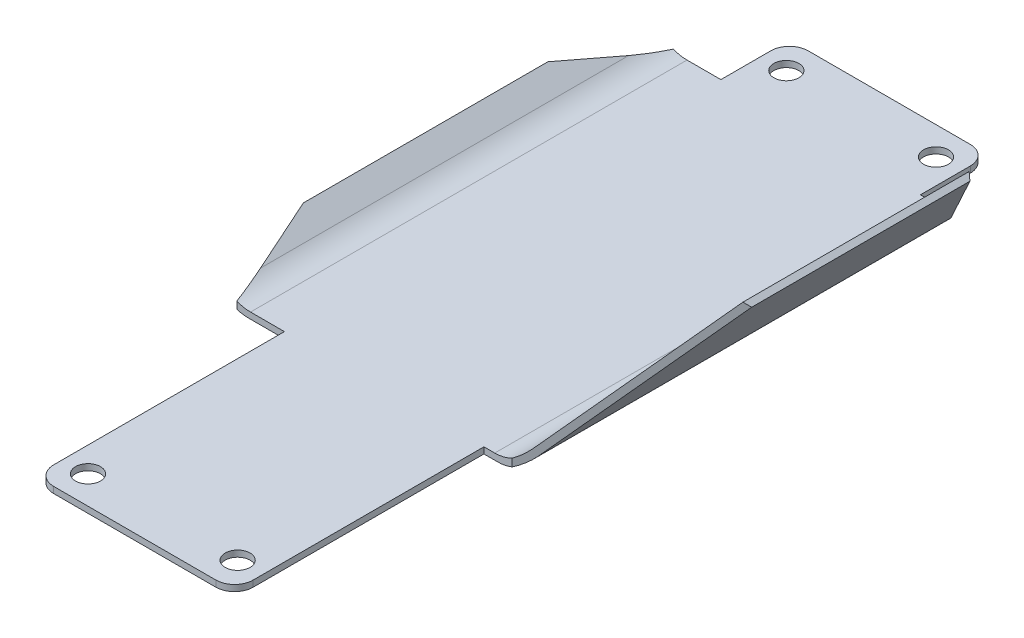
ISO-10303-21;
HEADER;
FILE_DESCRIPTION(('STEP AP214'),'2;1');
FILE_NAME('part.step','',(''),(''),'','','');
FILE_SCHEMA(('AUTOMOTIVE_DESIGN { 1 0 10303 214 1 1 1 1 }'));
ENDSEC;
DATA;
#1=APPLICATION_CONTEXT('core data for automotive mechanical design processes');
#2=APPLICATION_PROTOCOL_DEFINITION('international standard','automotive_design',2000,#1);
#3=PRODUCT_CONTEXT('',#1,'mechanical');
#4=PRODUCT('Part','Part','',(#3));
#5=PRODUCT_RELATED_PRODUCT_CATEGORY('part','',(#4));
#6=PRODUCT_DEFINITION_FORMATION('','',#4);
#7=PRODUCT_DEFINITION_CONTEXT('part definition',#1,'design');
#8=PRODUCT_DEFINITION('design','',#6,#7);
#9=PRODUCT_DEFINITION_SHAPE('','',#8);
#10=(LENGTH_UNIT() NAMED_UNIT(*) SI_UNIT(.MILLI.,.METRE.));
#11=(NAMED_UNIT(*) PLANE_ANGLE_UNIT() SI_UNIT($,.RADIAN.));
#12=(NAMED_UNIT(*) SI_UNIT($,.STERADIAN.) SOLID_ANGLE_UNIT());
#13=UNCERTAINTY_MEASURE_WITH_UNIT(LENGTH_MEASURE(1.E-05),#10,'distance_accuracy_value','');
#14=(GEOMETRIC_REPRESENTATION_CONTEXT(3) GLOBAL_UNCERTAINTY_ASSIGNED_CONTEXT((#13)) GLOBAL_UNIT_ASSIGNED_CONTEXT((#10,
#11,#12)) REPRESENTATION_CONTEXT('',''));
#15=CARTESIAN_POINT('',(0.,0.,0.));
#16=DIRECTION('',(0.,0.,1.));
#17=DIRECTION('',(1.,0.,0.));
#18=AXIS2_PLACEMENT_3D('',#15,#16,#17);
#19=CARTESIAN_POINT('',(-13.,0.,57.5));
#20=DIRECTION('',(0.,-1.,0.));
#21=DIRECTION('',(0.,0.,-1.));
#22=AXIS2_PLACEMENT_3D('',#19,#20,#21);
#23=PLANE('',#22);
#24=CARTESIAN_POINT('',(-12.,0.,-56.));
#25=DIRECTION('',(0.,1.,0.));
#26=DIRECTION('',(0.,0.,1.));
#27=AXIS2_PLACEMENT_3D('',#24,#25,#26);
#28=CIRCLE('',#27,2.);
#29=CARTESIAN_POINT('',(-12.,0.,-54.));
#30=VERTEX_POINT('',#29);
#31=EDGE_CURVE('E275',#30,#30,#28,.T.);
#32=ORIENTED_EDGE('',*,*,#31,.T.);
#33=EDGE_LOOP('',(#32));
#34=FACE_BOUND('',#33,.T.);
#35=CARTESIAN_POINT('',(12.,0.,-56.));
#36=DIRECTION('',(0.,1.,0.));
#37=DIRECTION('',(0.,0.,-1.));
#38=AXIS2_PLACEMENT_3D('',#35,#36,#37);
#39=CIRCLE('',#38,2.);
#40=CARTESIAN_POINT('',(12.,0.,-58.));
#41=VERTEX_POINT('',#40);
#42=EDGE_CURVE('E269',#41,#41,#39,.T.);
#43=ORIENTED_EDGE('',*,*,#42,.T.);
#44=EDGE_LOOP('',(#43));
#45=FACE_BOUND('',#44,.T.);
#46=CARTESIAN_POINT('',(-12.,0.,56.));
#47=DIRECTION('',(0.,1.,0.));
#48=DIRECTION('',(0.,0.,-1.));
#49=AXIS2_PLACEMENT_3D('',#46,#47,#48);
#50=CIRCLE('',#49,2.);
#51=CARTESIAN_POINT('',(-12.,0.,54.));
#52=VERTEX_POINT('',#51);
#53=EDGE_CURVE('E259',#52,#52,#50,.T.);
#54=ORIENTED_EDGE('',*,*,#53,.T.);
#55=EDGE_LOOP('',(#54));
#56=FACE_BOUND('',#55,.T.);
#57=CARTESIAN_POINT('',(12.,0.,56.));
#58=DIRECTION('',(0.,1.,0.));
#59=DIRECTION('',(0.,0.,1.));
#60=AXIS2_PLACEMENT_3D('',#57,#58,#59);
#61=CIRCLE('',#60,2.);
#62=CARTESIAN_POINT('',(12.,0.,58.));
#63=VERTEX_POINT('',#62);
#64=EDGE_CURVE('E263',#63,#63,#61,.T.);
#65=ORIENTED_EDGE('',*,*,#64,.T.);
#66=EDGE_LOOP('',(#65));
#67=FACE_BOUND('',#66,.T.);
#68=DIRECTION('',(1.,0.,0.));
#69=VECTOR('',#68,1.);
#70=CARTESIAN_POINT('',(-24.,0.,20.5));
#71=LINE('',#70,#69);
#72=CARTESIAN_POINT('',(-21.7996476918977,0.,20.5));
#73=VERTEX_POINT('',#72);
#74=CARTESIAN_POINT('',(-16.,0.,20.5));
#75=VERTEX_POINT('',#74);
#76=EDGE_CURVE('E435',#73,#75,#71,.T.);
#77=ORIENTED_EDGE('',*,*,#76,.F.);
#78=DIRECTION('',(0.,0.,1.));
#79=VECTOR('',#78,1.);
#80=CARTESIAN_POINT('',(-21.7996476918977,0.,57.5));
#81=LINE('',#80,#79);
#82=CARTESIAN_POINT('',(-21.7996476918977,0.,-49.5));
#83=VERTEX_POINT('',#82);
#84=EDGE_CURVE('E395',#73,#83,#81,.F.);
#85=ORIENTED_EDGE('',*,*,#84,.T.);
#86=DIRECTION('',(1.,0.,0.));
#87=VECTOR('',#86,1.);
#88=CARTESIAN_POINT('',(-24.,0.,-49.5));
#89=LINE('',#88,#87);
#90=CARTESIAN_POINT('',(-16.,0.,-49.5));
#91=VERTEX_POINT('',#90);
#92=EDGE_CURVE('E250',#83,#91,#89,.T.);
#93=ORIENTED_EDGE('',*,*,#92,.T.);
#94=DIRECTION('',(0.,0.,1.));
#95=VECTOR('',#94,1.);
#96=CARTESIAN_POINT('',(-16.,0.,57.5));
#97=LINE('',#96,#95);
#98=CARTESIAN_POINT('',(-16.,0.,-57.5));
#99=VERTEX_POINT('',#98);
#100=EDGE_CURVE('E288',#99,#91,#97,.T.);
#101=ORIENTED_EDGE('',*,*,#100,.F.);
#102=CARTESIAN_POINT('',(-13.,0.,-57.5));
#103=DIRECTION('',(0.,1.,0.));
#104=DIRECTION('',(0.,0.,-1.));
#105=AXIS2_PLACEMENT_3D('',#102,#103,#104);
#106=CIRCLE('',#105,3.);
#107=CARTESIAN_POINT('',(-13.,0.,-60.5));
#108=VERTEX_POINT('',#107);
#109=EDGE_CURVE('E320',#108,#99,#106,.T.);
#110=ORIENTED_EDGE('',*,*,#109,.F.);
#111=DIRECTION('',(-1.,0.,0.));
#112=VECTOR('',#111,1.);
#113=CARTESIAN_POINT('',(-13.,0.,-60.5));
#114=LINE('',#113,#112);
#115=CARTESIAN_POINT('',(13.,0.,-60.5));
#116=VERTEX_POINT('',#115);
#117=EDGE_CURVE('E318',#116,#108,#114,.T.);
#118=ORIENTED_EDGE('',*,*,#117,.F.);
#119=CARTESIAN_POINT('',(13.,0.,-57.5));
#120=DIRECTION('',(0.,1.,0.));
#121=DIRECTION('',(0.,0.,-1.));
#122=AXIS2_PLACEMENT_3D('',#119,#120,#121);
#123=CIRCLE('',#122,3.);
#124=CARTESIAN_POINT('',(16.,0.,-57.5));
#125=VERTEX_POINT('',#124);
#126=EDGE_CURVE('E316',#125,#116,#123,.T.);
#127=ORIENTED_EDGE('',*,*,#126,.F.);
#128=DIRECTION('',(0.,0.,-1.));
#129=VECTOR('',#128,1.);
#130=CARTESIAN_POINT('',(16.,0.,57.5));
#131=LINE('',#130,#129);
#132=CARTESIAN_POINT('',(16.,0.,-49.5));
#133=VERTEX_POINT('',#132);
#134=EDGE_CURVE('E313',#133,#125,#131,.T.);
#135=ORIENTED_EDGE('',*,*,#134,.F.);
#136=CARTESIAN_POINT('',(18.20215405107,0.,-49.5));
#137=VERTEX_POINT('',#136);
#138=EDGE_CURVE('E417',#133,#137,#89,.T.);
#139=ORIENTED_EDGE('',*,*,#138,.T.);
#140=DIRECTION('',(0.,0.,1.));
#141=VECTOR('',#140,1.);
#142=CARTESIAN_POINT('',(18.20215405107,0.,57.5));
#143=LINE('',#142,#141);
#144=CARTESIAN_POINT('',(18.20215405107,0.,20.5));
#145=VERTEX_POINT('',#144);
#146=EDGE_CURVE('E392',#137,#145,#143,.T.);
#147=ORIENTED_EDGE('',*,*,#146,.T.);
#148=CARTESIAN_POINT('',(16.,0.,20.5));
#149=VERTEX_POINT('',#148);
#150=EDGE_CURVE('E433',#149,#145,#71,.T.);
#151=ORIENTED_EDGE('',*,*,#150,.F.);
#152=CARTESIAN_POINT('',(16.,0.,57.5));
#153=VERTEX_POINT('',#152);
#154=EDGE_CURVE('E314',#153,#149,#131,.T.);
#155=ORIENTED_EDGE('',*,*,#154,.F.);
#156=CARTESIAN_POINT('',(13.,0.,57.5));
#157=DIRECTION('',(0.,1.,0.));
#158=DIRECTION('',(0.,0.,1.));
#159=AXIS2_PLACEMENT_3D('',#156,#157,#158);
#160=CIRCLE('',#159,3.);
#161=CARTESIAN_POINT('',(13.,0.,60.5));
#162=VERTEX_POINT('',#161);
#163=EDGE_CURVE('E311',#162,#153,#160,.T.);
#164=ORIENTED_EDGE('',*,*,#163,.F.);
#165=DIRECTION('',(1.,0.,0.));
#166=VECTOR('',#165,1.);
#167=CARTESIAN_POINT('',(-13.,0.,60.5));
#168=LINE('',#167,#166);
#169=CARTESIAN_POINT('',(-13.,0.,60.5));
#170=VERTEX_POINT('',#169);
#171=EDGE_CURVE('E309',#170,#162,#168,.T.);
#172=ORIENTED_EDGE('',*,*,#171,.F.);
#173=CARTESIAN_POINT('',(-13.,0.,57.5));
#174=DIRECTION('',(0.,1.,0.));
#175=DIRECTION('',(0.,0.,-1.));
#176=AXIS2_PLACEMENT_3D('',#173,#174,#175);
#177=CIRCLE('',#176,3.);
#178=CARTESIAN_POINT('',(-16.,0.,57.5));
#179=VERTEX_POINT('',#178);
#180=EDGE_CURVE('E281',#179,#170,#177,.T.);
#181=ORIENTED_EDGE('',*,*,#180,.F.);
#182=EDGE_CURVE('E322',#75,#179,#97,.T.);
#183=ORIENTED_EDGE('',*,*,#182,.F.);
#184=EDGE_LOOP('',(#77,#85,#93,#101,#110,#118,#127,#135,#139,#147,#151,#155,#164,#172,#181,#183));
#185=FACE_BOUND('',#184,.T.);
#186=ADVANCED_FACE('F33',(#34,#45,#56,#67,#185),#23,.T.);
#187=CARTESIAN_POINT('',(-24.,0.,-49.5));
#188=DIRECTION('',(-0.646504050809883,-0.762910553267165,0.));
#189=DIRECTION('',(0.762910553267165,-0.646504050809883,0.));
#190=AXIS2_PLACEMENT_3D('',#187,#188,#189);
#191=PLANE('',#190);
#192=DIRECTION('',(-0.284541894625022,0.24112589177381,0.927843852444735));
#193=VECTOR('',#192,1.);
#194=CARTESIAN_POINT('',(-23.6842882380084,-0.267539794988847,-49.3336530503948));
#195=LINE('',#194,#193);
#196=CARTESIAN_POINT('',(-25.678671996757,1.42253668039701,-42.8302989049211));
#197=VERTEX_POINT('',#196);
#198=CARTESIAN_POINT('',(-29.,4.23708944673283,-32.));
#199=VERTEX_POINT('',#198);
#200=EDGE_CURVE('E449',#197,#199,#195,.T.);
#201=ORIENTED_EDGE('',*,*,#200,.F.);
#202=DIRECTION('',(0.,0.,1.));
#203=VECTOR('',#202,1.);
#204=CARTESIAN_POINT('',(-25.678671996757,1.42253668039701,-49.5));
#205=LINE('',#204,#203);
#206=CARTESIAN_POINT('',(-25.678671996757,1.42253668039701,13.8302989049211));
#207=VERTEX_POINT('',#206);
#208=EDGE_CURVE('E385',#197,#207,#205,.T.);
#209=ORIENTED_EDGE('',*,*,#208,.T.);
#210=DIRECTION('',(-0.284541894625022,0.24112589177381,-0.927843852444735));
#211=VECTOR('',#210,1.);
#212=CARTESIAN_POINT('',(-42.1650195763647,15.393362549342,-39.9289419659694));
#213=LINE('',#212,#211);
#214=CARTESIAN_POINT('',(-29.,4.23708944673283,3.));
#215=VERTEX_POINT('',#214);
#216=EDGE_CURVE('E452',#207,#215,#213,.T.);
#217=ORIENTED_EDGE('',*,*,#216,.T.);
#218=DIRECTION('',(0.,0.,1.));
#219=VECTOR('',#218,1.);
#220=CARTESIAN_POINT('',(-29.,4.23708944673283,-49.5));
#221=LINE('',#220,#219);
#222=EDGE_CURVE('E248',#199,#215,#221,.T.);
#223=ORIENTED_EDGE('',*,*,#222,.F.);
#224=EDGE_LOOP('',(#201,#209,#217,#223));
#225=FACE_BOUND('',#224,.T.);
#226=ADVANCED_FACE('F448',(#225),#191,.T.);
#227=CARTESIAN_POINT('',(-28.3534959491901,5.,-49.5));
#228=DIRECTION('',(-0.762910553267166,0.646504050809882,0.));
#229=DIRECTION('',(-0.646504050809882,-0.762910553267166,0.));
#230=AXIS2_PLACEMENT_3D('',#227,#228,#229);
#231=PLANE('',#230);
#232=ORIENTED_EDGE('',*,*,#222,.T.);
#233=DIRECTION('',(0.277077755474065,0.32696708313264,0.903504534559283));
#234=VECTOR('',#233,1.);
#235=CARTESIAN_POINT('',(-42.0241533690322,-11.1321322003049,-39.4696006634774));
#236=LINE('',#235,#234);
#237=CARTESIAN_POINT('',(-28.3534959491901,5.,5.10814231737321));
#238=VERTEX_POINT('',#237);
#239=EDGE_CURVE('E444',#215,#238,#236,.T.);
#240=ORIENTED_EDGE('',*,*,#239,.T.);
#241=DIRECTION('',(0.,0.,1.));
#242=VECTOR('',#241,1.);
#243=CARTESIAN_POINT('',(-28.3534959491901,5.,-49.5));
#244=LINE('',#243,#242);
#245=CARTESIAN_POINT('',(-28.3534959491901,5.,-34.1081423173732));
#246=VERTEX_POINT('',#245);
#247=EDGE_CURVE('E244',#246,#238,#244,.T.);
#248=ORIENTED_EDGE('',*,*,#247,.F.);
#249=DIRECTION('',(0.277077755474065,0.32696708313264,-0.903504534559283));
#250=VECTOR('',#249,1.);
#251=CARTESIAN_POINT('',(-24.5002827742894,9.54700475803252,-46.6728304143657));
#252=LINE('',#251,#250);
#253=EDGE_CURVE('E445',#199,#246,#252,.T.);
#254=ORIENTED_EDGE('',*,*,#253,.F.);
#255=EDGE_LOOP('',(#232,#240,#248,#254));
#256=FACE_BOUND('',#255,.T.);
#257=ADVANCED_FACE('F441',(#256),#231,.T.);
#258=CARTESIAN_POINT('',(-23.6332746153163,1.,-49.5));
#259=DIRECTION('',(0.646504050809883,0.762910553267165,0.));
#260=DIRECTION('',(-0.762910553267165,0.646504050809883,0.));
#261=AXIS2_PLACEMENT_3D('',#258,#259,#260);
#262=PLANE('',#261);
#263=DIRECTION('',(0.284541894625022,-0.241125891773809,0.927843852444735));
#264=VECTOR('',#263,1.);
#265=CARTESIAN_POINT('',(-42.1140059536726,16.6609023443309,-39.7625950163642));
#266=LINE('',#265,#264);
#267=CARTESIAN_POINT('',(-25.3119466120733,2.42253668039701,15.0261294667532));
#268=VERTEX_POINT('',#267);
#269=EDGE_CURVE('E456',#238,#268,#266,.T.);
#270=ORIENTED_EDGE('',*,*,#269,.T.);
#271=DIRECTION('',(0.,0.,1.));
#272=VECTOR('',#271,1.);
#273=CARTESIAN_POINT('',(-25.3119466120733,2.42253668039701,-49.5));
#274=LINE('',#273,#272);
#275=CARTESIAN_POINT('',(-25.3119466120733,2.42253668039701,-44.0261294667532));
#276=VERTEX_POINT('',#275);
#277=EDGE_CURVE('E363',#268,#276,#274,.F.);
#278=ORIENTED_EDGE('',*,*,#277,.T.);
#279=DIRECTION('',(0.284541894625022,-0.241125891773809,-0.927843852444735));
#280=VECTOR('',#279,1.);
#281=CARTESIAN_POINT('',(-23.6332746153163,0.999999999999997,-49.5));
#282=LINE('',#281,#280);
#283=EDGE_CURVE('E462',#246,#276,#282,.T.);
#284=ORIENTED_EDGE('',*,*,#283,.F.);
#285=ORIENTED_EDGE('',*,*,#247,.T.);
#286=EDGE_LOOP('',(#270,#278,#284,#285));
#287=FACE_BOUND('',#286,.T.);
#288=ADVANCED_FACE('F722',(#287),#262,.T.);
#289=CARTESIAN_POINT('',(0.,0.,20.5));
#290=DIRECTION('',(0.,0.,-1.));
#291=DIRECTION('',(-1.,0.,0.));
#292=AXIS2_PLACEMENT_3D('',#289,#290,#291);
#293=PLANE('',#292);
#294=DIRECTION('',(0.,1.,0.));
#295=VECTOR('',#294,1.);
#296=CARTESIAN_POINT('',(-23.6332746153163,0.,20.5));
#297=LINE('',#296,#295);
#298=CARTESIAN_POINT('',(-23.6332746153163,0.287048721920121,20.5));
#299=VERTEX_POINT('',#298);
#300=CARTESIAN_POINT('',(-23.6332746153163,1.41802456828867,20.5));
#301=VERTEX_POINT('',#300);
#302=EDGE_CURVE('E356',#299,#301,#297,.T.);
#303=ORIENTED_EDGE('',*,*,#302,.F.);
#304=CARTESIAN_POINT('',(-21.7996476918977,6.,20.5));
#305=DIRECTION('',(0.,0.,-1.));
#306=DIRECTION('',(-1.,0.,0.));
#307=AXIS2_PLACEMENT_3D('',#304,#305,#306);
#308=CIRCLE('',#307,6.);
#309=EDGE_CURVE('E390',#299,#73,#308,.F.);
#310=ORIENTED_EDGE('',*,*,#309,.T.);
#311=ORIENTED_EDGE('',*,*,#76,.T.);
#312=DIRECTION('',(0.,1.,0.));
#313=VECTOR('',#312,1.);
#314=CARTESIAN_POINT('',(-16.,1.,20.5));
#315=LINE('',#314,#313);
#316=CARTESIAN_POINT('',(-16.,1.,20.5));
#317=VERTEX_POINT('',#316);
#318=EDGE_CURVE('E348',#75,#317,#315,.T.);
#319=ORIENTED_EDGE('',*,*,#318,.T.);
#320=DIRECTION('',(-1.,0.,0.));
#321=VECTOR('',#320,1.);
#322=CARTESIAN_POINT('',(-23.6332746153163,1.,20.5));
#323=LINE('',#322,#321);
#324=CARTESIAN_POINT('',(-21.432922307214,1.,20.5));
#325=VERTEX_POINT('',#324);
#326=EDGE_CURVE('E434',#317,#325,#323,.T.);
#327=ORIENTED_EDGE('',*,*,#326,.T.);
#328=CARTESIAN_POINT('',(-21.432922307214,7.,20.5));
#329=DIRECTION('',(0.,0.,-1.));
#330=DIRECTION('',(-1.,0.,0.));
#331=AXIS2_PLACEMENT_3D('',#328,#329,#330);
#332=CIRCLE('',#331,6.);
#333=EDGE_CURVE('E366',#325,#301,#332,.T.);
#334=ORIENTED_EDGE('',*,*,#333,.T.);
#335=EDGE_LOOP('',(#303,#310,#311,#319,#327,#334));
#336=FACE_BOUND('',#335,.T.);
#337=ADVANCED_FACE('F511',(#336),#293,.F.);
#338=CARTESIAN_POINT('',(0.,0.,-49.5));
#339=DIRECTION('',(0.,0.,-1.));
#340=DIRECTION('',(-1.,0.,0.));
#341=AXIS2_PLACEMENT_3D('',#338,#339,#340);
#342=PLANE('',#341);
#343=DIRECTION('',(0.,-1.,0.));
#344=VECTOR('',#343,1.);
#345=CARTESIAN_POINT('',(20.533692341845,70.,-49.5));
#346=LINE('',#345,#344);
#347=CARTESIAN_POINT('',(20.533692341845,1.69226432025328,-49.5));
#348=VERTEX_POINT('',#347);
#349=CARTESIAN_POINT('',(20.533692341845,0.471534643443086,-49.5));
#350=VERTEX_POINT('',#349);
#351=EDGE_CURVE('E418',#348,#350,#346,.T.);
#352=ORIENTED_EDGE('',*,*,#351,.T.);
#353=CARTESIAN_POINT('',(18.20215405107,6.,-49.5));
#354=DIRECTION('',(0.,0.,-1.));
#355=DIRECTION('',(-1.,0.,0.));
#356=AXIS2_PLACEMENT_3D('',#353,#354,#355);
#357=CIRCLE('',#356,6.);
#358=EDGE_CURVE('E11',#350,#137,#357,.T.);
#359=ORIENTED_EDGE('',*,*,#358,.T.);
#360=ORIENTED_EDGE('',*,*,#138,.F.);
#361=DIRECTION('',(0.,-1.,0.));
#362=VECTOR('',#361,1.);
#363=CARTESIAN_POINT('',(16.,1.,-49.5));
#364=LINE('',#363,#362);
#365=CARTESIAN_POINT('',(16.,1.,-49.5));
#366=VERTEX_POINT('',#365);
#367=EDGE_CURVE('E257',#366,#133,#364,.T.);
#368=ORIENTED_EDGE('',*,*,#367,.F.);
#369=DIRECTION('',(-1.,0.,0.));
#370=VECTOR('',#369,1.);
#371=CARTESIAN_POINT('',(-23.6332746153163,1.,-49.5));
#372=LINE('',#371,#370);
#373=CARTESIAN_POINT('',(17.735846392915,1.,-49.5));
#374=VERTEX_POINT('',#373);
#375=EDGE_CURVE('E425',#374,#366,#372,.T.);
#376=ORIENTED_EDGE('',*,*,#375,.F.);
#377=CARTESIAN_POINT('',(17.735846392915,7.,-49.5));
#378=DIRECTION('',(0.,0.,-1.));
#379=DIRECTION('',(-1.,0.,0.));
#380=AXIS2_PLACEMENT_3D('',#377,#378,#379);
#381=CIRCLE('',#380,6.);
#382=EDGE_CURVE('E380',#374,#348,#381,.F.);
#383=ORIENTED_EDGE('',*,*,#382,.T.);
#384=EDGE_LOOP('',(#352,#359,#360,#368,#376,#383));
#385=FACE_BOUND('',#384,.T.);
#386=ADVANCED_FACE('F415',(#385),#342,.T.);
#387=CARTESIAN_POINT('',(21.,0.,-49.5));
#388=DIRECTION('',(0.76604444311898,-0.642787609686537,0.));
#389=DIRECTION('',(0.642787609686537,0.76604444311898,0.));
#390=AXIS2_PLACEMENT_3D('',#387,#388,#389);
#391=PLANE('',#390);
#392=DIRECTION('',(0.566040115034933,0.674580340645325,-0.473856467916264));
#393=VECTOR('',#392,1.);
#394=CARTESIAN_POINT('',(39.6708191733897,22.2510158265642,4.47948999444729));
#395=LINE('',#394,#393);
#396=CARTESIAN_POINT('',(22.7984207097839,2.14327434188078,18.6040987083485));
#397=VERTEX_POINT('',#396);
#398=CARTESIAN_POINT('',(41.4381279332186,24.3572123903135,3.));
#399=VERTEX_POINT('',#398);
#400=EDGE_CURVE('E223',#397,#399,#395,.T.);
#401=ORIENTED_EDGE('',*,*,#400,.F.);
#402=DIRECTION('',(0.,0.,1.));
#403=VECTOR('',#402,1.);
#404=CARTESIAN_POINT('',(22.7984207097839,2.14327434188078,-49.5));
#405=LINE('',#404,#403);
#406=CARTESIAN_POINT('',(22.7984207097839,2.14327434188078,-47.6040987083485));
#407=VERTEX_POINT('',#406);
#408=EDGE_CURVE('E55',#397,#407,#405,.F.);
#409=ORIENTED_EDGE('',*,*,#408,.T.);
#410=DIRECTION('',(0.566040115034933,0.674580340645325,0.473856467916264));
#411=VECTOR('',#410,1.);
#412=CARTESIAN_POINT('',(20.8952953007339,-0.124782201511901,-49.1972866474727));
#413=LINE('',#412,#411);
#414=CARTESIAN_POINT('',(41.4381279332186,24.3572123903135,-32.));
#415=VERTEX_POINT('',#414);
#416=EDGE_CURVE('E465',#407,#415,#413,.T.);
#417=ORIENTED_EDGE('',*,*,#416,.T.);
#418=DIRECTION('',(0.,0.,1.));
#419=VECTOR('',#418,1.);
#420=CARTESIAN_POINT('',(41.4381279332186,24.3572123903135,-49.5));
#421=LINE('',#420,#419);
#422=EDGE_CURVE('E245',#415,#399,#421,.T.);
#423=ORIENTED_EDGE('',*,*,#422,.T.);
#424=EDGE_LOOP('',(#401,#409,#417,#423));
#425=FACE_BOUND('',#424,.T.);
#426=ADVANCED_FACE('F407',(#425),#391,.T.);
#427=CARTESIAN_POINT('',(20.533692341845,1.,-49.5));
#428=DIRECTION('',(-0.76604444311898,0.642787609686537,0.));
#429=DIRECTION('',(-0.642787609686537,-0.76604444311898,0.));
#430=AXIS2_PLACEMENT_3D('',#427,#428,#429);
#431=PLANE('',#430);
#432=DIRECTION('',(-0.566040115034933,-0.674580340645325,-0.473856467916264));
#433=VECTOR('',#432,1.);
#434=CARTESIAN_POINT('',(20.533692341845,1.,-49.5));
#435=LINE('',#434,#433);
#436=CARTESIAN_POINT('',(40.6720834900996,25.,-32.641288672731));
#437=VERTEX_POINT('',#436);
#438=CARTESIAN_POINT('',(22.3321130516289,3.14327434188078,-47.9944648572954));
#439=VERTEX_POINT('',#438);
#440=EDGE_CURVE('E408',#437,#439,#435,.T.);
#441=ORIENTED_EDGE('',*,*,#440,.T.);
#442=DIRECTION('',(0.,0.,1.));
#443=VECTOR('',#442,1.);
#444=CARTESIAN_POINT('',(22.3321130516289,3.14327434188078,-49.5));
#445=LINE('',#444,#443);
#446=CARTESIAN_POINT('',(22.3321130516289,3.14327434188078,18.9944648572954));
#447=VERTEX_POINT('',#446);
#448=EDGE_CURVE('E238',#439,#447,#445,.T.);
#449=ORIENTED_EDGE('',*,*,#448,.T.);
#450=DIRECTION('',(-0.566040115034933,-0.674580340645325,0.473856467916264));
#451=VECTOR('',#450,1.);
#452=CARTESIAN_POINT('',(39.3092162145008,23.3757980280761,4.78220334697457));
#453=LINE('',#452,#451);
#454=CARTESIAN_POINT('',(40.6720834900996,25.,3.64128867273096));
#455=VERTEX_POINT('',#454);
#456=EDGE_CURVE('E222',#455,#447,#453,.T.);
#457=ORIENTED_EDGE('',*,*,#456,.F.);
#458=DIRECTION('',(0.,0.,1.));
#459=VECTOR('',#458,1.);
#460=CARTESIAN_POINT('',(40.6720834900996,25.,-49.5));
#461=LINE('',#460,#459);
#462=EDGE_CURVE('E236',#437,#455,#461,.T.);
#463=ORIENTED_EDGE('',*,*,#462,.F.);
#464=EDGE_LOOP('',(#441,#449,#457,#463));
#465=FACE_BOUND('',#464,.T.);
#466=ADVANCED_FACE('F235',(#465),#431,.T.);
#467=CARTESIAN_POINT('',(40.6720834900996,25.,-49.5));
#468=DIRECTION('',(0.642787609686539,0.766044443118978,0.));
#469=DIRECTION('',(-0.766044443118978,0.642787609686539,0.));
#470=AXIS2_PLACEMENT_3D('',#467,#468,#469);
#471=PLANE('',#470);
#472=ORIENTED_EDGE('',*,*,#422,.F.);
#473=DIRECTION('',(-0.644839763946836,0.541084808096234,-0.539823035151753));
#474=VECTOR('',#473,1.);
#475=CARTESIAN_POINT('',(34.8035768909236,29.92426172293,-37.5540673524844));
#476=LINE('',#475,#474);
#477=EDGE_CURVE('E228',#415,#437,#476,.T.);
#478=ORIENTED_EDGE('',*,*,#477,.T.);
#479=ORIENTED_EDGE('',*,*,#462,.T.);
#480=DIRECTION('',(-0.644839763946836,0.541084808096234,0.539823035151753));
#481=VECTOR('',#480,1.);
#482=CARTESIAN_POINT('',(59.1705319901461,9.47795868625909,-11.8445562971472));
#483=LINE('',#482,#481);
#484=EDGE_CURVE('E217',#399,#455,#483,.T.);
#485=ORIENTED_EDGE('',*,*,#484,.F.);
#486=EDGE_LOOP('',(#472,#478,#479,#485));
#487=FACE_BOUND('',#486,.T.);
#488=ADVANCED_FACE('F242',(#487),#471,.T.);
#489=CARTESIAN_POINT('',(16.,1.,57.5));
#490=DIRECTION('',(-1.,0.,0.));
#491=DIRECTION('',(0.,0.,1.));
#492=AXIS2_PLACEMENT_3D('',#489,#490,#491);
#493=PLANE('',#492);
#494=DIRECTION('',(0.,-1.,0.));
#495=VECTOR('',#494,1.);
#496=CARTESIAN_POINT('',(16.,1.,20.5));
#497=LINE('',#496,#495);
#498=CARTESIAN_POINT('',(16.,1.,20.5));
#499=VERTEX_POINT('',#498);
#500=EDGE_CURVE('E254',#499,#149,#497,.T.);
#501=ORIENTED_EDGE('',*,*,#500,.F.);
#502=DIRECTION('',(0.,0.,-1.));
#503=VECTOR('',#502,1.);
#504=CARTESIAN_POINT('',(16.,1.,57.5));
#505=LINE('',#504,#503);
#506=CARTESIAN_POINT('',(16.,1.,57.5));
#507=VERTEX_POINT('',#506);
#508=EDGE_CURVE('E293',#507,#499,#505,.T.);
#509=ORIENTED_EDGE('',*,*,#508,.F.);
#510=DIRECTION('',(0.,-1.,0.));
#511=VECTOR('',#510,1.);
#512=CARTESIAN_POINT('',(16.,1.,57.5));
#513=LINE('',#512,#511);
#514=EDGE_CURVE('E339',#507,#153,#513,.T.);
#515=ORIENTED_EDGE('',*,*,#514,.T.);
#516=ORIENTED_EDGE('',*,*,#154,.T.);
#517=EDGE_LOOP('',(#501,#509,#515,#516));
#518=FACE_BOUND('',#517,.T.);
#519=ADVANCED_FACE('F488',(#518),#493,.F.);
#520=CARTESIAN_POINT('',(-16.,1.,57.5));
#521=DIRECTION('',(1.,0.,0.));
#522=DIRECTION('',(0.,0.,-1.));
#523=AXIS2_PLACEMENT_3D('',#520,#521,#522);
#524=PLANE('',#523);
#525=ORIENTED_EDGE('',*,*,#318,.F.);
#526=ORIENTED_EDGE('',*,*,#182,.T.);
#527=DIRECTION('',(0.,-1.,0.));
#528=VECTOR('',#527,1.);
#529=CARTESIAN_POINT('',(-16.,1.,57.5));
#530=LINE('',#529,#528);
#531=CARTESIAN_POINT('',(-16.,1.,57.5));
#532=VERTEX_POINT('',#531);
#533=EDGE_CURVE('E306',#532,#179,#530,.T.);
#534=ORIENTED_EDGE('',*,*,#533,.F.);
#535=DIRECTION('',(0.,0.,1.));
#536=VECTOR('',#535,1.);
#537=CARTESIAN_POINT('',(-16.,1.,57.5));
#538=LINE('',#537,#536);
#539=EDGE_CURVE('E302',#317,#532,#538,.T.);
#540=ORIENTED_EDGE('',*,*,#539,.F.);
#541=EDGE_LOOP('',(#525,#526,#534,#540));
#542=FACE_BOUND('',#541,.T.);
#543=ADVANCED_FACE('F506',(#542),#524,.F.);
#544=CARTESIAN_POINT('',(-13.,1.,57.5));
#545=DIRECTION('',(0.,-1.,0.));
#546=DIRECTION('',(0.,0.,-1.));
#547=AXIS2_PLACEMENT_3D('',#544,#545,#546);
#548=PLANE('',#547);
#549=CARTESIAN_POINT('',(-16.,1.,-49.5));
#550=VERTEX_POINT('',#549);
#551=CARTESIAN_POINT('',(-21.432922307214,1.,-49.5));
#552=VERTEX_POINT('',#551);
#553=EDGE_CURVE('E427',#550,#552,#372,.T.);
#554=ORIENTED_EDGE('',*,*,#553,.T.);
#555=DIRECTION('',(0.,0.,1.));
#556=VECTOR('',#555,1.);
#557=CARTESIAN_POINT('',(-21.432922307214,1.,57.5));
#558=LINE('',#557,#556);
#559=EDGE_CURVE('E360',#552,#325,#558,.T.);
#560=ORIENTED_EDGE('',*,*,#559,.T.);
#561=ORIENTED_EDGE('',*,*,#326,.F.);
#562=ORIENTED_EDGE('',*,*,#539,.T.);
#563=CARTESIAN_POINT('',(-13.,1.,57.5));
#564=DIRECTION('',(0.,1.,0.));
#565=DIRECTION('',(0.,0.,-1.));
#566=AXIS2_PLACEMENT_3D('',#563,#564,#565);
#567=CIRCLE('',#566,3.);
#568=CARTESIAN_POINT('',(-13.,1.,60.5));
#569=VERTEX_POINT('',#568);
#570=EDGE_CURVE('E284',#532,#569,#567,.T.);
#571=ORIENTED_EDGE('',*,*,#570,.T.);
#572=DIRECTION('',(1.,0.,0.));
#573=VECTOR('',#572,1.);
#574=CARTESIAN_POINT('',(-13.,1.,60.5));
#575=LINE('',#574,#573);
#576=CARTESIAN_POINT('',(13.,1.,60.5));
#577=VERTEX_POINT('',#576);
#578=EDGE_CURVE('E287',#569,#577,#575,.T.);
#579=ORIENTED_EDGE('',*,*,#578,.T.);
#580=CARTESIAN_POINT('',(13.,1.,57.5));
#581=DIRECTION('',(0.,1.,0.));
#582=DIRECTION('',(0.,0.,1.));
#583=AXIS2_PLACEMENT_3D('',#580,#581,#582);
#584=CIRCLE('',#583,3.);
#585=EDGE_CURVE('E290',#577,#507,#584,.T.);
#586=ORIENTED_EDGE('',*,*,#585,.T.);
#587=ORIENTED_EDGE('',*,*,#508,.T.);
#588=CARTESIAN_POINT('',(17.735846392915,1.,20.5));
#589=VERTEX_POINT('',#588);
#590=EDGE_CURVE('E431',#589,#499,#323,.T.);
#591=ORIENTED_EDGE('',*,*,#590,.F.);
#592=DIRECTION('',(0.,0.,1.));
#593=VECTOR('',#592,1.);
#594=CARTESIAN_POINT('',(17.735846392915,1.,57.5));
#595=LINE('',#594,#593);
#596=EDGE_CURVE('E358',#589,#374,#595,.F.);
#597=ORIENTED_EDGE('',*,*,#596,.T.);
#598=ORIENTED_EDGE('',*,*,#375,.T.);
#599=CARTESIAN_POINT('',(16.,1.,-57.5));
#600=VERTEX_POINT('',#599);
#601=EDGE_CURVE('E292',#366,#600,#505,.T.);
#602=ORIENTED_EDGE('',*,*,#601,.T.);
#603=CARTESIAN_POINT('',(13.,1.,-57.5));
#604=DIRECTION('',(0.,1.,0.));
#605=DIRECTION('',(0.,0.,-1.));
#606=AXIS2_PLACEMENT_3D('',#603,#604,#605);
#607=CIRCLE('',#606,3.);
#608=CARTESIAN_POINT('',(13.,1.,-60.5));
#609=VERTEX_POINT('',#608);
#610=EDGE_CURVE('E296',#600,#609,#607,.T.);
#611=ORIENTED_EDGE('',*,*,#610,.T.);
#612=DIRECTION('',(-1.,0.,0.));
#613=VECTOR('',#612,1.);
#614=CARTESIAN_POINT('',(-13.,1.,-60.5));
#615=LINE('',#614,#613);
#616=CARTESIAN_POINT('',(-13.,1.,-60.5));
#617=VERTEX_POINT('',#616);
#618=EDGE_CURVE('E298',#609,#617,#615,.T.);
#619=ORIENTED_EDGE('',*,*,#618,.T.);
#620=CARTESIAN_POINT('',(-13.,1.,-57.5));
#621=DIRECTION('',(0.,1.,0.));
#622=DIRECTION('',(0.,0.,-1.));
#623=AXIS2_PLACEMENT_3D('',#620,#621,#622);
#624=CIRCLE('',#623,3.);
#625=CARTESIAN_POINT('',(-16.,1.,-57.5));
#626=VERTEX_POINT('',#625);
#627=EDGE_CURVE('E300',#617,#626,#624,.T.);
#628=ORIENTED_EDGE('',*,*,#627,.T.);
#629=EDGE_CURVE('E303',#626,#550,#538,.T.);
#630=ORIENTED_EDGE('',*,*,#629,.T.);
#631=EDGE_LOOP('',(#554,#560,#561,#562,#571,#579,#586,#587,#591,#597,#598,#602,#611,#619,#628,#630));
#632=FACE_BOUND('',#631,.T.);
#633=CARTESIAN_POINT('',(-12.,1.,-56.));
#634=DIRECTION('',(0.,1.,0.));
#635=DIRECTION('',(0.,0.,1.));
#636=AXIS2_PLACEMENT_3D('',#633,#634,#635);
#637=CIRCLE('',#636,2.);
#638=CARTESIAN_POINT('',(-12.,1.,-54.));
#639=VERTEX_POINT('',#638);
#640=EDGE_CURVE('E278',#639,#639,#637,.T.);
#641=ORIENTED_EDGE('',*,*,#640,.F.);
#642=EDGE_LOOP('',(#641));
#643=FACE_BOUND('',#642,.T.);
#644=CARTESIAN_POINT('',(12.,1.,-56.));
#645=DIRECTION('',(0.,1.,0.));
#646=DIRECTION('',(0.,0.,-1.));
#647=AXIS2_PLACEMENT_3D('',#644,#645,#646);
#648=CIRCLE('',#647,2.);
#649=CARTESIAN_POINT('',(12.,1.,-58.));
#650=VERTEX_POINT('',#649);
#651=EDGE_CURVE('E272',#650,#650,#648,.T.);
#652=ORIENTED_EDGE('',*,*,#651,.F.);
#653=EDGE_LOOP('',(#652));
#654=FACE_BOUND('',#653,.T.);
#655=CARTESIAN_POINT('',(-12.,1.,56.));
#656=DIRECTION('',(0.,1.,0.));
#657=DIRECTION('',(0.,0.,-1.));
#658=AXIS2_PLACEMENT_3D('',#655,#656,#657);
#659=CIRCLE('',#658,2.);
#660=CARTESIAN_POINT('',(-12.,1.,54.));
#661=VERTEX_POINT('',#660);
#662=EDGE_CURVE('E260',#661,#661,#659,.T.);
#663=ORIENTED_EDGE('',*,*,#662,.F.);
#664=EDGE_LOOP('',(#663));
#665=FACE_BOUND('',#664,.T.);
#666=CARTESIAN_POINT('',(12.,1.,56.));
#667=DIRECTION('',(0.,1.,0.));
#668=DIRECTION('',(0.,0.,1.));
#669=AXIS2_PLACEMENT_3D('',#666,#667,#668);
#670=CIRCLE('',#669,2.);
#671=CARTESIAN_POINT('',(12.,1.,58.));
#672=VERTEX_POINT('',#671);
#673=EDGE_CURVE('E266',#672,#672,#670,.T.);
#674=ORIENTED_EDGE('',*,*,#673,.F.);
#675=EDGE_LOOP('',(#674));
#676=FACE_BOUND('',#675,.T.);
#677=ADVANCED_FACE('F481',(#632,#643,#654,#665,#676),#548,.F.);
#678=CARTESIAN_POINT('',(-13.,1.,57.5));
#679=DIRECTION('',(0.,-1.,0.));
#680=DIRECTION('',(0.,0.,-1.));
#681=AXIS2_PLACEMENT_3D('',#678,#679,#680);
#682=CYLINDRICAL_SURFACE('',#681,3.);
#683=ORIENTED_EDGE('',*,*,#180,.T.);
#684=DIRECTION('',(0.,-1.,0.));
#685=VECTOR('',#684,1.);
#686=CARTESIAN_POINT('',(-13.,1.,60.5));
#687=LINE('',#686,#685);
#688=EDGE_CURVE('E345',#569,#170,#687,.T.);
#689=ORIENTED_EDGE('',*,*,#688,.F.);
#690=ORIENTED_EDGE('',*,*,#570,.F.);
#691=ORIENTED_EDGE('',*,*,#533,.T.);
#692=EDGE_LOOP('',(#683,#689,#690,#691));
#693=FACE_BOUND('',#692,.T.);
#694=ADVANCED_FACE('F500',(#693),#682,.T.);
#695=CARTESIAN_POINT('',(-13.,1.,60.5));
#696=DIRECTION('',(0.,0.,-1.));
#697=DIRECTION('',(-1.,0.,0.));
#698=AXIS2_PLACEMENT_3D('',#695,#696,#697);
#699=PLANE('',#698);
#700=ORIENTED_EDGE('',*,*,#171,.T.);
#701=DIRECTION('',(0.,-1.,0.));
#702=VECTOR('',#701,1.);
#703=CARTESIAN_POINT('',(13.,1.,60.5));
#704=LINE('',#703,#702);
#705=EDGE_CURVE('E342',#577,#162,#704,.T.);
#706=ORIENTED_EDGE('',*,*,#705,.F.);
#707=ORIENTED_EDGE('',*,*,#578,.F.);
#708=ORIENTED_EDGE('',*,*,#688,.T.);
#709=EDGE_LOOP('',(#700,#706,#707,#708));
#710=FACE_BOUND('',#709,.T.);
#711=ADVANCED_FACE('F496',(#710),#699,.F.);
#712=CARTESIAN_POINT('',(13.,1.,57.5));
#713=DIRECTION('',(0.,-1.,0.));
#714=DIRECTION('',(0.,0.,-1.));
#715=AXIS2_PLACEMENT_3D('',#712,#713,#714);
#716=CYLINDRICAL_SURFACE('',#715,3.);
#717=ORIENTED_EDGE('',*,*,#163,.T.);
#718=ORIENTED_EDGE('',*,*,#514,.F.);
#719=ORIENTED_EDGE('',*,*,#585,.F.);
#720=ORIENTED_EDGE('',*,*,#705,.T.);
#721=EDGE_LOOP('',(#717,#718,#719,#720));
#722=FACE_BOUND('',#721,.T.);
#723=ADVANCED_FACE('F493',(#722),#716,.T.);
#724=ORIENTED_EDGE('',*,*,#601,.F.);
#725=ORIENTED_EDGE('',*,*,#367,.T.);
#726=ORIENTED_EDGE('',*,*,#134,.T.);
#727=DIRECTION('',(0.,-1.,0.));
#728=VECTOR('',#727,1.);
#729=CARTESIAN_POINT('',(16.,1.,-57.5));
#730=LINE('',#729,#728);
#731=EDGE_CURVE('E336',#600,#125,#730,.T.);
#732=ORIENTED_EDGE('',*,*,#731,.F.);
#733=EDGE_LOOP('',(#724,#725,#726,#732));
#734=FACE_BOUND('',#733,.T.);
#735=ADVANCED_FACE('F550',(#734),#493,.F.);
#736=CARTESIAN_POINT('',(13.,1.,-57.5));
#737=DIRECTION('',(0.,-1.,0.));
#738=DIRECTION('',(0.,0.,-1.));
#739=AXIS2_PLACEMENT_3D('',#736,#737,#738);
#740=CYLINDRICAL_SURFACE('',#739,3.);
#741=ORIENTED_EDGE('',*,*,#126,.T.);
#742=DIRECTION('',(0.,-1.,0.));
#743=VECTOR('',#742,1.);
#744=CARTESIAN_POINT('',(13.,1.,-60.5));
#745=LINE('',#744,#743);
#746=EDGE_CURVE('E333',#609,#116,#745,.T.);
#747=ORIENTED_EDGE('',*,*,#746,.F.);
#748=ORIENTED_EDGE('',*,*,#610,.F.);
#749=ORIENTED_EDGE('',*,*,#731,.T.);
#750=EDGE_LOOP('',(#741,#747,#748,#749));
#751=FACE_BOUND('',#750,.T.);
#752=ADVANCED_FACE('F546',(#751),#740,.T.);
#753=CARTESIAN_POINT('',(-13.,1.,-60.5));
#754=DIRECTION('',(0.,0.,1.));
#755=DIRECTION('',(1.,0.,0.));
#756=AXIS2_PLACEMENT_3D('',#753,#754,#755);
#757=PLANE('',#756);
#758=ORIENTED_EDGE('',*,*,#117,.T.);
#759=DIRECTION('',(0.,-1.,0.));
#760=VECTOR('',#759,1.);
#761=CARTESIAN_POINT('',(-13.,1.,-60.5));
#762=LINE('',#761,#760);
#763=EDGE_CURVE('E330',#617,#108,#762,.T.);
#764=ORIENTED_EDGE('',*,*,#763,.F.);
#765=ORIENTED_EDGE('',*,*,#618,.F.);
#766=ORIENTED_EDGE('',*,*,#746,.T.);
#767=EDGE_LOOP('',(#758,#764,#765,#766));
#768=FACE_BOUND('',#767,.T.);
#769=ADVANCED_FACE('F542',(#768),#757,.F.);
#770=CARTESIAN_POINT('',(-13.,1.,-57.5));
#771=DIRECTION('',(0.,-1.,0.));
#772=DIRECTION('',(0.,0.,-1.));
#773=AXIS2_PLACEMENT_3D('',#770,#771,#772);
#774=CYLINDRICAL_SURFACE('',#773,3.);
#775=ORIENTED_EDGE('',*,*,#109,.T.);
#776=DIRECTION('',(0.,-1.,0.));
#777=VECTOR('',#776,1.);
#778=CARTESIAN_POINT('',(-16.,1.,-57.5));
#779=LINE('',#778,#777);
#780=EDGE_CURVE('E327',#626,#99,#779,.T.);
#781=ORIENTED_EDGE('',*,*,#780,.F.);
#782=ORIENTED_EDGE('',*,*,#627,.F.);
#783=ORIENTED_EDGE('',*,*,#763,.T.);
#784=EDGE_LOOP('',(#775,#781,#782,#783));
#785=FACE_BOUND('',#784,.T.);
#786=ADVANCED_FACE('F538',(#785),#774,.T.);
#787=ORIENTED_EDGE('',*,*,#100,.T.);
#788=DIRECTION('',(0.,1.,0.));
#789=VECTOR('',#788,1.);
#790=CARTESIAN_POINT('',(-16.,1.,-49.5));
#791=LINE('',#790,#789);
#792=EDGE_CURVE('E229',#91,#550,#791,.T.);
#793=ORIENTED_EDGE('',*,*,#792,.T.);
#794=ORIENTED_EDGE('',*,*,#629,.F.);
#795=ORIENTED_EDGE('',*,*,#780,.T.);
#796=EDGE_LOOP('',(#787,#793,#794,#795));
#797=FACE_BOUND('',#796,.T.);
#798=ADVANCED_FACE('F532',(#797),#524,.F.);
#799=CARTESIAN_POINT('',(-12.,1.,-56.));
#800=DIRECTION('',(0.,-1.,0.));
#801=DIRECTION('',(0.,0.,-1.));
#802=AXIS2_PLACEMENT_3D('',#799,#800,#801);
#803=CYLINDRICAL_SURFACE('',#802,2.);
#804=ORIENTED_EDGE('',*,*,#640,.T.);
#805=EDGE_LOOP('',(#804));
#806=FACE_BOUND('',#805,.T.);
#807=ORIENTED_EDGE('',*,*,#31,.F.);
#808=EDGE_LOOP('',(#807));
#809=FACE_BOUND('',#808,.T.);
#810=ADVANCED_FACE('F573',(#806,#809),#803,.F.);
#811=CARTESIAN_POINT('',(12.,1.,-56.));
#812=DIRECTION('',(0.,-1.,0.));
#813=DIRECTION('',(0.,0.,-1.));
#814=AXIS2_PLACEMENT_3D('',#811,#812,#813);
#815=CYLINDRICAL_SURFACE('',#814,2.);
#816=ORIENTED_EDGE('',*,*,#651,.T.);
#817=EDGE_LOOP('',(#816));
#818=FACE_BOUND('',#817,.T.);
#819=ORIENTED_EDGE('',*,*,#42,.F.);
#820=EDGE_LOOP('',(#819));
#821=FACE_BOUND('',#820,.T.);
#822=ADVANCED_FACE('F596',(#818,#821),#815,.F.);
#823=CARTESIAN_POINT('',(12.,1.,56.));
#824=DIRECTION('',(0.,-1.,0.));
#825=DIRECTION('',(0.,0.,-1.));
#826=AXIS2_PLACEMENT_3D('',#823,#824,#825);
#827=CYLINDRICAL_SURFACE('',#826,2.);
#828=ORIENTED_EDGE('',*,*,#673,.T.);
#829=EDGE_LOOP('',(#828));
#830=FACE_BOUND('',#829,.T.);
#831=ORIENTED_EDGE('',*,*,#64,.F.);
#832=EDGE_LOOP('',(#831));
#833=FACE_BOUND('',#832,.T.);
#834=ADVANCED_FACE('F603',(#830,#833),#827,.F.);
#835=CARTESIAN_POINT('',(-12.,1.,56.));
#836=DIRECTION('',(0.,-1.,0.));
#837=DIRECTION('',(0.,0.,-1.));
#838=AXIS2_PLACEMENT_3D('',#835,#836,#837);
#839=CYLINDRICAL_SURFACE('',#838,2.);
#840=ORIENTED_EDGE('',*,*,#662,.T.);
#841=EDGE_LOOP('',(#840));
#842=FACE_BOUND('',#841,.T.);
#843=ORIENTED_EDGE('',*,*,#53,.F.);
#844=EDGE_LOOP('',(#843));
#845=FACE_BOUND('',#844,.T.);
#846=ADVANCED_FACE('F611',(#842,#845),#839,.F.);
#847=ORIENTED_EDGE('',*,*,#92,.F.);
#848=CARTESIAN_POINT('',(-21.7996476918977,6.,-49.5));
#849=DIRECTION('',(0.,0.,-1.));
#850=DIRECTION('',(-1.,0.,0.));
#851=AXIS2_PLACEMENT_3D('',#848,#849,#850);
#852=CIRCLE('',#851,6.);
#853=CARTESIAN_POINT('',(-23.6332746153163,0.287048721920121,-49.5));
#854=VERTEX_POINT('',#853);
#855=EDGE_CURVE('E397',#83,#854,#852,.T.);
#856=ORIENTED_EDGE('',*,*,#855,.T.);
#857=DIRECTION('',(0.,-1.,0.));
#858=VECTOR('',#857,1.);
#859=CARTESIAN_POINT('',(-23.6332746153163,0.,-49.5));
#860=LINE('',#859,#858);
#861=CARTESIAN_POINT('',(-23.6332746153163,1.41802456828867,-49.5));
#862=VERTEX_POINT('',#861);
#863=EDGE_CURVE('E353',#862,#854,#860,.T.);
#864=ORIENTED_EDGE('',*,*,#863,.F.);
#865=CARTESIAN_POINT('',(-21.432922307214,7.,-49.5));
#866=DIRECTION('',(0.,0.,-1.));
#867=DIRECTION('',(-1.,0.,0.));
#868=AXIS2_PLACEMENT_3D('',#865,#866,#867);
#869=CIRCLE('',#868,6.);
#870=EDGE_CURVE('E374',#862,#552,#869,.F.);
#871=ORIENTED_EDGE('',*,*,#870,.T.);
#872=ORIENTED_EDGE('',*,*,#553,.F.);
#873=ORIENTED_EDGE('',*,*,#792,.F.);
#874=EDGE_LOOP('',(#847,#856,#864,#871,#872,#873));
#875=FACE_BOUND('',#874,.T.);
#876=ADVANCED_FACE('F529',(#875),#342,.T.);
#877=ORIENTED_EDGE('',*,*,#150,.T.);
#878=CARTESIAN_POINT('',(18.20215405107,6.,20.5));
#879=DIRECTION('',(0.,0.,-1.));
#880=DIRECTION('',(-1.,0.,0.));
#881=AXIS2_PLACEMENT_3D('',#878,#879,#880);
#882=CIRCLE('',#881,6.);
#883=CARTESIAN_POINT('',(20.533692341845,0.471534643443086,20.5));
#884=VERTEX_POINT('',#883);
#885=EDGE_CURVE('E401',#145,#884,#882,.F.);
#886=ORIENTED_EDGE('',*,*,#885,.T.);
#887=DIRECTION('',(0.,-1.,0.));
#888=VECTOR('',#887,1.);
#889=CARTESIAN_POINT('',(20.533692341845,70.,20.5));
#890=LINE('',#889,#888);
#891=CARTESIAN_POINT('',(20.533692341845,1.69226432025328,20.5));
#892=VERTEX_POINT('',#891);
#893=EDGE_CURVE('E239',#892,#884,#890,.T.);
#894=ORIENTED_EDGE('',*,*,#893,.F.);
#895=CARTESIAN_POINT('',(17.735846392915,7.,20.5));
#896=DIRECTION('',(0.,0.,-1.));
#897=DIRECTION('',(-1.,0.,0.));
#898=AXIS2_PLACEMENT_3D('',#895,#896,#897);
#899=CIRCLE('',#898,6.);
#900=EDGE_CURVE('E378',#892,#589,#899,.T.);
#901=ORIENTED_EDGE('',*,*,#900,.T.);
#902=ORIENTED_EDGE('',*,*,#590,.T.);
#903=ORIENTED_EDGE('',*,*,#500,.T.);
#904=EDGE_LOOP('',(#877,#886,#894,#901,#902,#903));
#905=FACE_BOUND('',#904,.T.);
#906=ADVANCED_FACE('F477',(#905),#293,.F.);
#907=CARTESIAN_POINT('',(18.5509510585772,70.,22.1598378035858));
#908=DIRECTION('',(-0.641906725063048,0.,-0.766782730842859));
#909=DIRECTION('',(-0.766782730842859,0.,0.641906725063048));
#910=AXIS2_PLACEMENT_3D('',#907,#908,#909);
#911=PLANE('',#910);
#912=ORIENTED_EDGE('',*,*,#893,.T.);
#913=CARTESIAN_POINT('',(18.20215405107,6.,22.4518307447344));
#914=DIRECTION('',(-0.641906725063048,0.,-0.766782730842859));
#915=DIRECTION('',(-0.766782730842859,0.,0.641906725063048));
#916=AXIS2_PLACEMENT_3D('',#913,#914,#915);
#917=ELLIPSE('',#916,7.82490235976586,6.);
#918=EDGE_CURVE('E403',#884,#397,#917,.F.);
#919=ORIENTED_EDGE('',*,*,#918,.T.);
#920=ORIENTED_EDGE('',*,*,#400,.T.);
#921=ORIENTED_EDGE('',*,*,#484,.T.);
#922=ORIENTED_EDGE('',*,*,#456,.T.);
#923=CARTESIAN_POINT('',(17.735846392915,7.,22.8421968936812));
#924=DIRECTION('',(-0.641906725063048,0.,-0.766782730842859));
#925=DIRECTION('',(-0.766782730842859,0.,0.641906725063048));
#926=AXIS2_PLACEMENT_3D('',#923,#924,#925);
#927=ELLIPSE('',#926,7.82490235976586,6.);
#928=EDGE_CURVE('E376',#447,#892,#927,.T.);
#929=ORIENTED_EDGE('',*,*,#928,.T.);
#930=EDGE_LOOP('',(#912,#919,#920,#921,#922,#929));
#931=FACE_BOUND('',#930,.T.);
#932=ADVANCED_FACE('F220',(#931),#911,.F.);
#933=CARTESIAN_POINT('',(32.8248378146942,70.,-39.2105547368319));
#934=DIRECTION('',(0.641906725063048,0.,-0.766782730842859));
#935=DIRECTION('',(-0.766782730842859,0.,-0.641906725063048));
#936=AXIS2_PLACEMENT_3D('',#933,#934,#935);
#937=PLANE('',#936);
#938=ORIENTED_EDGE('',*,*,#416,.F.);
#939=CARTESIAN_POINT('',(18.20215405107,6.,-51.4518307447344));
#940=DIRECTION('',(0.641906725063048,0.,-0.766782730842859));
#941=DIRECTION('',(0.766782730842859,0.,0.641906725063048));
#942=AXIS2_PLACEMENT_3D('',#939,#940,#941);
#943=ELLIPSE('',#942,7.82490235976586,6.);
#944=EDGE_CURVE('E41',#407,#350,#943,.T.);
#945=ORIENTED_EDGE('',*,*,#944,.T.);
#946=ORIENTED_EDGE('',*,*,#351,.F.);
#947=CARTESIAN_POINT('',(17.735846392915,7.,-51.8421968936813));
#948=DIRECTION('',(0.641906725063048,0.,-0.766782730842859));
#949=DIRECTION('',(0.766782730842859,0.,0.641906725063048));
#950=AXIS2_PLACEMENT_3D('',#947,#948,#949);
#951=ELLIPSE('',#950,7.82490235976586,6.);
#952=EDGE_CURVE('E383',#348,#439,#951,.F.);
#953=ORIENTED_EDGE('',*,*,#952,.T.);
#954=ORIENTED_EDGE('',*,*,#440,.F.);
#955=ORIENTED_EDGE('',*,*,#477,.F.);
#956=EDGE_LOOP('',(#938,#945,#946,#953,#954,#955));
#957=FACE_BOUND('',#956,.T.);
#958=ADVANCED_FACE('F640',(#957),#937,.T.);
#959=CARTESIAN_POINT('',(-35.4769569839139,70.,-10.8797191781087));
#960=DIRECTION('',(0.956053309010391,0.,0.29319288929011));
#961=DIRECTION('',(0.29319288929011,0.,-0.956053309010391));
#962=AXIS2_PLACEMENT_3D('',#959,#960,#961);
#963=PLANE('',#962);
#964=ORIENTED_EDGE('',*,*,#863,.T.);
#965=CARTESIAN_POINT('',(-21.7996476918977,6.,-55.4791528091606));
#966=DIRECTION('',(0.956053309010391,0.,0.29319288929011));
#967=DIRECTION('',(-0.29319288929011,0.,0.956053309010391));
#968=AXIS2_PLACEMENT_3D('',#965,#966,#967);
#969=ELLIPSE('',#968,20.4643435061725,6.);
#970=EDGE_CURVE('E399',#854,#197,#969,.F.);
#971=ORIENTED_EDGE('',*,*,#970,.T.);
#972=ORIENTED_EDGE('',*,*,#200,.T.);
#973=ORIENTED_EDGE('',*,*,#253,.T.);
#974=ORIENTED_EDGE('',*,*,#283,.T.);
#975=CARTESIAN_POINT('',(-21.432922307214,7.,-56.6749833709927));
#976=DIRECTION('',(0.956053309010391,0.,0.29319288929011));
#977=DIRECTION('',(-0.29319288929011,0.,0.956053309010391));
#978=AXIS2_PLACEMENT_3D('',#975,#976,#977);
#979=ELLIPSE('',#978,20.4643435061725,6.);
#980=EDGE_CURVE('E371',#276,#862,#979,.T.);
#981=ORIENTED_EDGE('',*,*,#980,.T.);
#982=EDGE_LOOP('',(#964,#971,#972,#973,#974,#981));
#983=FACE_BOUND('',#982,.T.);
#984=ADVANCED_FACE('F647',(#983),#963,.F.);
#985=CARTESIAN_POINT('',(-27.3480240563742,70.,8.38681913853051));
#986=DIRECTION('',(-0.956053309010391,0.,0.29319288929011));
#987=DIRECTION('',(0.29319288929011,0.,0.956053309010391));
#988=AXIS2_PLACEMENT_3D('',#985,#986,#987);
#989=PLANE('',#988);
#990=ORIENTED_EDGE('',*,*,#216,.F.);
#991=CARTESIAN_POINT('',(-21.7996476918977,6.,26.4791528091606));
#992=DIRECTION('',(-0.956053309010391,0.,0.29319288929011));
#993=DIRECTION('',(0.29319288929011,0.,0.956053309010391));
#994=AXIS2_PLACEMENT_3D('',#991,#992,#993);
#995=ELLIPSE('',#994,20.4643435061725,6.);
#996=EDGE_CURVE('E388',#207,#299,#995,.T.);
#997=ORIENTED_EDGE('',*,*,#996,.T.);
#998=ORIENTED_EDGE('',*,*,#302,.T.);
#999=CARTESIAN_POINT('',(-21.432922307214,7.,27.6749833709927));
#1000=DIRECTION('',(-0.956053309010391,0.,0.29319288929011));
#1001=DIRECTION('',(0.29319288929011,0.,0.956053309010391));
#1002=AXIS2_PLACEMENT_3D('',#999,#1000,#1001);
#1003=ELLIPSE('',#1002,20.4643435061725,6.);
#1004=EDGE_CURVE('E369',#301,#268,#1003,.F.);
#1005=ORIENTED_EDGE('',*,*,#1004,.T.);
#1006=ORIENTED_EDGE('',*,*,#269,.F.);
#1007=ORIENTED_EDGE('',*,*,#239,.F.);
#1008=EDGE_LOOP('',(#990,#997,#998,#1005,#1006,#1007));
#1009=FACE_BOUND('',#1008,.T.);
#1010=ADVANCED_FACE('F454',(#1009),#989,.T.);
#1011=CARTESIAN_POINT('',(-21.432922307214,7.,57.5));
#1012=DIRECTION('',(0.,0.,1.));
#1013=DIRECTION('',(1.,0.,0.));
#1014=AXIS2_PLACEMENT_3D('',#1011,#1012,#1013);
#1015=CYLINDRICAL_SURFACE('',#1014,6.);
#1016=ORIENTED_EDGE('',*,*,#980,.F.);
#1017=ORIENTED_EDGE('',*,*,#277,.F.);
#1018=ORIENTED_EDGE('',*,*,#1004,.F.);
#1019=ORIENTED_EDGE('',*,*,#333,.F.);
#1020=ORIENTED_EDGE('',*,*,#559,.F.);
#1021=ORIENTED_EDGE('',*,*,#870,.F.);
#1022=EDGE_LOOP('',(#1016,#1017,#1018,#1019,#1020,#1021));
#1023=FACE_BOUND('',#1022,.T.);
#1024=ADVANCED_FACE('F517',(#1023),#1015,.F.);
#1025=CARTESIAN_POINT('',(17.735846392915,7.,-49.5));
#1026=DIRECTION('',(0.,0.,1.));
#1027=DIRECTION('',(1.,0.,0.));
#1028=AXIS2_PLACEMENT_3D('',#1025,#1026,#1027);
#1029=CYLINDRICAL_SURFACE('',#1028,6.);
#1030=ORIENTED_EDGE('',*,*,#382,.F.);
#1031=ORIENTED_EDGE('',*,*,#596,.F.);
#1032=ORIENTED_EDGE('',*,*,#900,.F.);
#1033=ORIENTED_EDGE('',*,*,#928,.F.);
#1034=ORIENTED_EDGE('',*,*,#448,.F.);
#1035=ORIENTED_EDGE('',*,*,#952,.F.);
#1036=EDGE_LOOP('',(#1030,#1031,#1032,#1033,#1034,#1035));
#1037=FACE_BOUND('',#1036,.T.);
#1038=ADVANCED_FACE('F472',(#1037),#1029,.F.);
#1039=CARTESIAN_POINT('',(-21.7996476918977,6.,-49.5));
#1040=DIRECTION('',(0.,0.,1.));
#1041=DIRECTION('',(1.,0.,0.));
#1042=AXIS2_PLACEMENT_3D('',#1039,#1040,#1041);
#1043=CYLINDRICAL_SURFACE('',#1042,6.);
#1044=ORIENTED_EDGE('',*,*,#855,.F.);
#1045=ORIENTED_EDGE('',*,*,#84,.F.);
#1046=ORIENTED_EDGE('',*,*,#309,.F.);
#1047=ORIENTED_EDGE('',*,*,#996,.F.);
#1048=ORIENTED_EDGE('',*,*,#208,.F.);
#1049=ORIENTED_EDGE('',*,*,#970,.F.);
#1050=EDGE_LOOP('',(#1044,#1045,#1046,#1047,#1048,#1049));
#1051=FACE_BOUND('',#1050,.T.);
#1052=ADVANCED_FACE('F523',(#1051),#1043,.T.);
#1053=CARTESIAN_POINT('',(18.20215405107,6.,57.5));
#1054=DIRECTION('',(0.,0.,1.));
#1055=DIRECTION('',(1.,0.,0.));
#1056=AXIS2_PLACEMENT_3D('',#1053,#1054,#1055);
#1057=CYLINDRICAL_SURFACE('',#1056,6.);
#1058=ORIENTED_EDGE('',*,*,#944,.F.);
#1059=ORIENTED_EDGE('',*,*,#408,.F.);
#1060=ORIENTED_EDGE('',*,*,#918,.F.);
#1061=ORIENTED_EDGE('',*,*,#885,.F.);
#1062=ORIENTED_EDGE('',*,*,#146,.F.);
#1063=ORIENTED_EDGE('',*,*,#358,.F.);
#1064=EDGE_LOOP('',(#1058,#1059,#1060,#1061,#1062,#1063));
#1065=FACE_BOUND('',#1064,.T.);
#1066=ADVANCED_FACE('F35',(#1065),#1057,.T.);
#1067=CLOSED_SHELL('',(#186,#226,#257,#288,#337,#386,#426,#466,#488,#519,#543,#677,#694,#711,
#723,#735,#752,#769,#786,#798,#810,#822,#834,#846,#876,#906,#932,#958,#984,#1010,#1024,#1038,
#1052,#1066));
#1068=MANIFOLD_SOLID_BREP('B2',#1067);
#1069=ADVANCED_BREP_SHAPE_REPRESENTATION('',(#18,#1068),#14);
#1070=SHAPE_DEFINITION_REPRESENTATION(#9,#1069);
ENDSEC;
END-ISO-10303-21;
